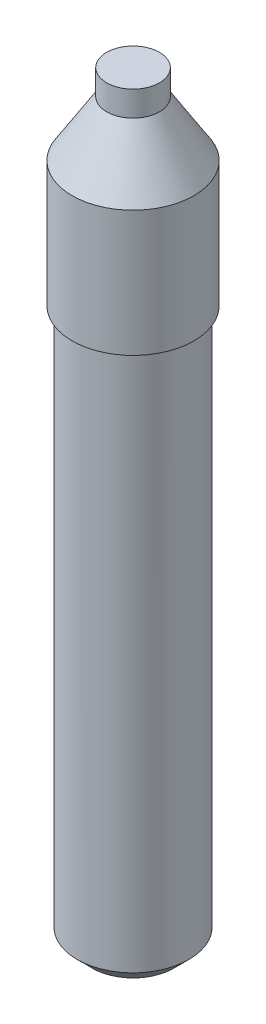
ISO-10303-21;
HEADER;
FILE_DESCRIPTION(('STEP AP214'),'2;1');
FILE_NAME('part.step','',(''),(''),'','','');
FILE_SCHEMA(('AUTOMOTIVE_DESIGN { 1 0 10303 214 1 1 1 1 }'));
ENDSEC;
DATA;
#1=APPLICATION_CONTEXT('core data for automotive mechanical design processes');
#2=APPLICATION_PROTOCOL_DEFINITION('international standard','automotive_design',2000,#1);
#3=PRODUCT_CONTEXT('',#1,'mechanical');
#4=PRODUCT('Part','Part','',(#3));
#5=PRODUCT_RELATED_PRODUCT_CATEGORY('part','',(#4));
#6=PRODUCT_DEFINITION_FORMATION('','',#4);
#7=PRODUCT_DEFINITION_CONTEXT('part definition',#1,'design');
#8=PRODUCT_DEFINITION('design','',#6,#7);
#9=PRODUCT_DEFINITION_SHAPE('','',#8);
#10=(LENGTH_UNIT() NAMED_UNIT(*) SI_UNIT(.MILLI.,.METRE.));
#11=(NAMED_UNIT(*) PLANE_ANGLE_UNIT() SI_UNIT($,.RADIAN.));
#12=(NAMED_UNIT(*) SI_UNIT($,.STERADIAN.) SOLID_ANGLE_UNIT());
#13=UNCERTAINTY_MEASURE_WITH_UNIT(LENGTH_MEASURE(1.E-05),#10,'distance_accuracy_value','');
#14=(GEOMETRIC_REPRESENTATION_CONTEXT(3) GLOBAL_UNCERTAINTY_ASSIGNED_CONTEXT((#13)) GLOBAL_UNIT_ASSIGNED_CONTEXT((#10,
#11,#12)) REPRESENTATION_CONTEXT('',''));
#15=CARTESIAN_POINT('',(0.,0.,0.));
#16=DIRECTION('',(0.,0.,1.));
#17=DIRECTION('',(1.,0.,0.));
#18=AXIS2_PLACEMENT_3D('',#15,#16,#17);
#19=CARTESIAN_POINT('',(-11.1125,-151.,0.));
#20=DIRECTION('',(0.,1.,0.));
#21=DIRECTION('',(-1.,0.,0.));
#22=AXIS2_PLACEMENT_3D('',#19,#20,#21);
#23=PLANE('',#22);
#24=CARTESIAN_POINT('',(0.,-151.,0.));
#25=DIRECTION('',(0.,1.,0.));
#26=DIRECTION('',(-1.,0.,0.));
#27=AXIS2_PLACEMENT_3D('',#24,#25,#26);
#28=CIRCLE('',#27,8.11250000000004);
#29=CARTESIAN_POINT('',(-8.11250000000004,-151.,0.));
#30=VERTEX_POINT('',#29);
#31=EDGE_CURVE('E51',#30,#30,#28,.F.);
#32=ORIENTED_EDGE('',*,*,#31,.T.);
#33=EDGE_LOOP('',(#32));
#34=FACE_BOUND('',#33,.T.);
#35=CARTESIAN_POINT('',(0.,-151.,0.));
#36=DIRECTION('',(0.,-1.,0.));
#37=DIRECTION('',(1.,0.,0.));
#38=AXIS2_PLACEMENT_3D('',#35,#36,#37);
#39=CIRCLE('',#38,7.9375);
#40=CARTESIAN_POINT('',(7.93749999999999,-151.,0.));
#41=VERTEX_POINT('',#40);
#42=EDGE_CURVE('E82',#41,#41,#39,.T.);
#43=ORIENTED_EDGE('',*,*,#42,.F.);
#44=EDGE_LOOP('',(#43));
#45=FACE_BOUND('',#44,.T.);
#46=ADVANCED_FACE('F42',(#34,#45),#23,.F.);
#47=CARTESIAN_POINT('',(-5.25,0.,0.));
#48=DIRECTION('',(0.,-1.,0.));
#49=DIRECTION('',(1.,0.,0.));
#50=AXIS2_PLACEMENT_3D('',#47,#48,#49);
#51=PLANE('',#50);
#52=CARTESIAN_POINT('',(0.,0.,0.));
#53=DIRECTION('',(0.,-1.,0.));
#54=DIRECTION('',(1.,0.,0.));
#55=AXIS2_PLACEMENT_3D('',#52,#53,#54);
#56=CIRCLE('',#55,5.25);
#57=CARTESIAN_POINT('',(5.25,0.,0.));
#58=VERTEX_POINT('',#57);
#59=EDGE_CURVE('E57',#58,#58,#56,.T.);
#60=ORIENTED_EDGE('',*,*,#59,.F.);
#61=EDGE_LOOP('',(#60));
#62=FACE_BOUND('',#61,.T.);
#63=ADVANCED_FACE('F101',(#62),#51,.F.);
#64=CARTESIAN_POINT('',(0.,-151.,0.));
#65=DIRECTION('',(0.,-1.,0.));
#66=DIRECTION('',(1.,0.,0.));
#67=AXIS2_PLACEMENT_3D('',#64,#65,#66);
#68=CYLINDRICAL_SURFACE('',#67,5.25);
#69=CARTESIAN_POINT('',(0.,-5.,0.));
#70=DIRECTION('',(0.,-1.,0.));
#71=DIRECTION('',(1.,0.,0.));
#72=AXIS2_PLACEMENT_3D('',#69,#70,#71);
#73=CIRCLE('',#72,5.25);
#74=CARTESIAN_POINT('',(5.25,-5.,0.));
#75=VERTEX_POINT('',#74);
#76=EDGE_CURVE('E63',#75,#75,#73,.T.);
#77=ORIENTED_EDGE('',*,*,#76,.F.);
#78=EDGE_LOOP('',(#77));
#79=FACE_BOUND('',#78,.T.);
#80=ORIENTED_EDGE('',*,*,#59,.T.);
#81=EDGE_LOOP('',(#80));
#82=FACE_BOUND('',#81,.T.);
#83=ADVANCED_FACE('F107',(#79,#82),#68,.T.);
#84=CARTESIAN_POINT('',(0.,-5.,0.));
#85=DIRECTION('',(0.,-1.,0.));
#86=DIRECTION('',(1.,0.,0.));
#87=AXIS2_PLACEMENT_3D('',#84,#85,#86);
#88=CONICAL_SURFACE('',#87,5.25,0.557781737600332);
#89=CARTESIAN_POINT('',(0.,-16.,0.));
#90=DIRECTION('',(0.,-1.,0.));
#91=DIRECTION('',(1.,0.,0.));
#92=AXIS2_PLACEMENT_3D('',#89,#90,#91);
#93=CIRCLE('',#92,12.1125);
#94=CARTESIAN_POINT('',(12.1125,-16.,0.));
#95=VERTEX_POINT('',#94);
#96=EDGE_CURVE('E69',#95,#95,#93,.T.);
#97=ORIENTED_EDGE('',*,*,#96,.F.);
#98=EDGE_LOOP('',(#97));
#99=FACE_BOUND('',#98,.T.);
#100=ORIENTED_EDGE('',*,*,#76,.T.);
#101=EDGE_LOOP('',(#100));
#102=FACE_BOUND('',#101,.T.);
#103=ADVANCED_FACE('F113',(#99,#102),#88,.T.);
#104=CARTESIAN_POINT('',(0.,-151.,0.));
#105=DIRECTION('',(0.,-1.,0.));
#106=DIRECTION('',(1.,0.,0.));
#107=AXIS2_PLACEMENT_3D('',#104,#105,#106);
#108=CYLINDRICAL_SURFACE('',#107,12.1125);
#109=CARTESIAN_POINT('',(0.,-41.,0.));
#110=DIRECTION('',(0.,-1.,0.));
#111=DIRECTION('',(1.,0.,0.));
#112=AXIS2_PLACEMENT_3D('',#109,#110,#111);
#113=CIRCLE('',#112,12.1125);
#114=CARTESIAN_POINT('',(12.1125,-41.,0.));
#115=VERTEX_POINT('',#114);
#116=EDGE_CURVE('E73',#115,#115,#113,.T.);
#117=ORIENTED_EDGE('',*,*,#116,.F.);
#118=EDGE_LOOP('',(#117));
#119=FACE_BOUND('',#118,.T.);
#120=ORIENTED_EDGE('',*,*,#96,.T.);
#121=EDGE_LOOP('',(#120));
#122=FACE_BOUND('',#121,.T.);
#123=ADVANCED_FACE('F117',(#119,#122),#108,.T.);
#124=CARTESIAN_POINT('',(-11.1125,-41.,0.));
#125=DIRECTION('',(0.,1.,0.));
#126=DIRECTION('',(-1.,0.,0.));
#127=AXIS2_PLACEMENT_3D('',#124,#125,#126);
#128=PLANE('',#127);
#129=CARTESIAN_POINT('',(0.,-41.,0.));
#130=DIRECTION('',(0.,-1.,0.));
#131=DIRECTION('',(1.,0.,0.));
#132=AXIS2_PLACEMENT_3D('',#129,#130,#131);
#133=CIRCLE('',#132,11.1125);
#134=CARTESIAN_POINT('',(11.1125,-41.,0.));
#135=VERTEX_POINT('',#134);
#136=EDGE_CURVE('E77',#135,#135,#133,.T.);
#137=ORIENTED_EDGE('',*,*,#136,.F.);
#138=EDGE_LOOP('',(#137));
#139=FACE_BOUND('',#138,.T.);
#140=ORIENTED_EDGE('',*,*,#116,.T.);
#141=EDGE_LOOP('',(#140));
#142=FACE_BOUND('',#141,.T.);
#143=ADVANCED_FACE('F121',(#139,#142),#128,.F.);
#144=CARTESIAN_POINT('',(0.,-151.,0.));
#145=DIRECTION('',(0.,-1.,0.));
#146=DIRECTION('',(1.,0.,0.));
#147=AXIS2_PLACEMENT_3D('',#144,#145,#146);
#148=CYLINDRICAL_SURFACE('',#147,11.1125);
#149=CARTESIAN_POINT('',(0.,-148.,0.));
#150=DIRECTION('',(0.,1.,0.));
#151=DIRECTION('',(-1.,0.,0.));
#152=AXIS2_PLACEMENT_3D('',#149,#150,#151);
#153=CIRCLE('',#152,11.1125);
#154=CARTESIAN_POINT('',(-11.1125,-148.,0.));
#155=VERTEX_POINT('',#154);
#156=EDGE_CURVE('E10',#155,#155,#153,.T.);
#157=ORIENTED_EDGE('',*,*,#156,.T.);
#158=EDGE_LOOP('',(#157));
#159=FACE_BOUND('',#158,.T.);
#160=ORIENTED_EDGE('',*,*,#136,.T.);
#161=EDGE_LOOP('',(#160));
#162=FACE_BOUND('',#161,.T.);
#163=ADVANCED_FACE('F96',(#159,#162),#148,.T.);
#164=CARTESIAN_POINT('',(0.,-49.4,0.));
#165=DIRECTION('',(0.,-1.,0.));
#166=DIRECTION('',(1.,0.,0.));
#167=AXIS2_PLACEMENT_3D('',#164,#165,#166);
#168=CYLINDRICAL_SURFACE('',#167,7.9375);
#169=CARTESIAN_POINT('',(0.,-49.4,0.));
#170=DIRECTION('',(0.,-1.,0.));
#171=DIRECTION('',(1.,0.,0.));
#172=AXIS2_PLACEMENT_3D('',#169,#170,#171);
#173=CIRCLE('',#172,7.9375);
#174=CARTESIAN_POINT('',(7.93750000000001,-49.4,0.));
#175=VERTEX_POINT('',#174);
#176=EDGE_CURVE('E81',#175,#175,#173,.T.);
#177=ORIENTED_EDGE('',*,*,#176,.F.);
#178=EDGE_LOOP('',(#177));
#179=FACE_BOUND('',#178,.T.);
#180=ORIENTED_EDGE('',*,*,#42,.T.);
#181=EDGE_LOOP('',(#180));
#182=FACE_BOUND('',#181,.T.);
#183=ADVANCED_FACE('F93',(#179,#182),#168,.F.);
#184=CARTESIAN_POINT('',(0.,-49.4,0.));
#185=DIRECTION('',(0.,-1.,0.));
#186=DIRECTION('',(1.,0.,0.));
#187=AXIS2_PLACEMENT_3D('',#184,#185,#186);
#188=PLANE('',#187);
#189=ORIENTED_EDGE('',*,*,#176,.T.);
#190=EDGE_LOOP('',(#189));
#191=FACE_BOUND('',#190,.T.);
#192=ADVANCED_FACE('F91',(#191),#188,.T.);
#193=CARTESIAN_POINT('',(0.,-151.,0.));
#194=DIRECTION('',(0.,1.,0.));
#195=DIRECTION('',(-1.,0.,0.));
#196=AXIS2_PLACEMENT_3D('',#193,#194,#195);
#197=CONICAL_SURFACE('',#196,8.11250000000004,0.785398163397451);
#198=ORIENTED_EDGE('',*,*,#156,.F.);
#199=EDGE_LOOP('',(#198));
#200=FACE_BOUND('',#199,.T.);
#201=ORIENTED_EDGE('',*,*,#31,.F.);
#202=EDGE_LOOP('',(#201));
#203=FACE_BOUND('',#202,.T.);
#204=ADVANCED_FACE('F45',(#200,#203),#197,.T.);
#205=CLOSED_SHELL('',(#46,#63,#83,#103,#123,#143,#163,#183,#192,#204));
#206=MANIFOLD_SOLID_BREP('B2',#205);
#207=ADVANCED_BREP_SHAPE_REPRESENTATION('',(#18,#206),#14);
#208=SHAPE_DEFINITION_REPRESENTATION(#9,#207);
ENDSEC;
END-ISO-10303-21;
